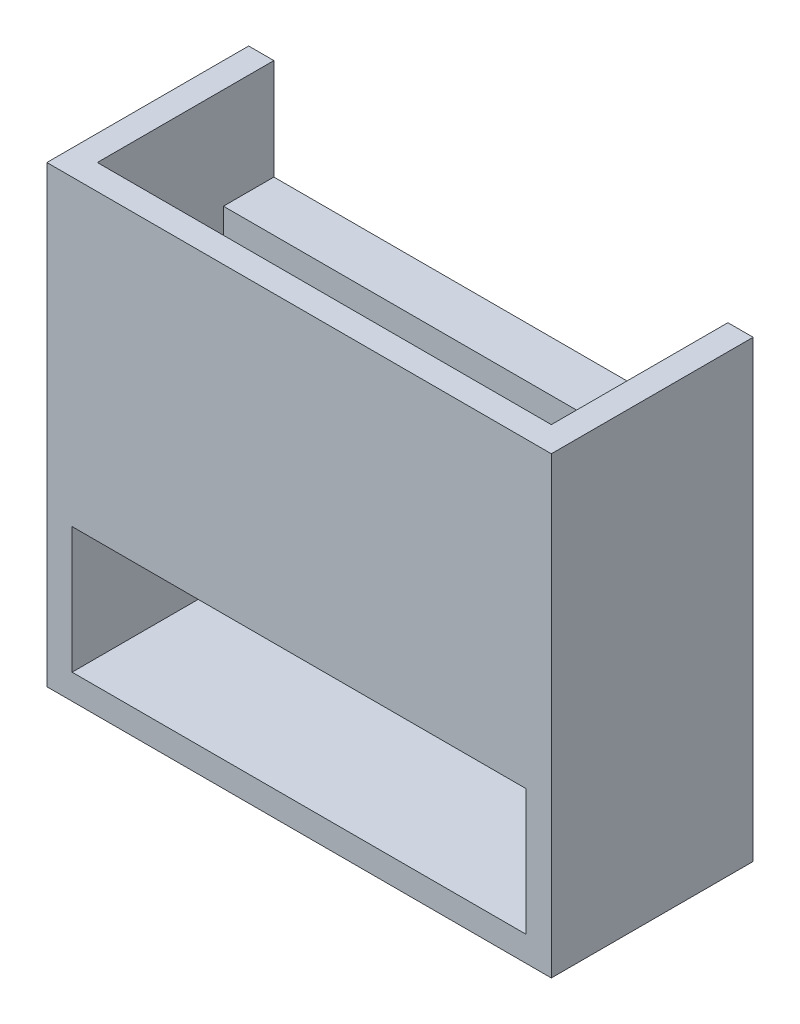
ISO-10303-21;
HEADER;
FILE_DESCRIPTION(('STEP AP214'),'2;1');
FILE_NAME('part.step','',(''),(''),'','','');
FILE_SCHEMA(('AUTOMOTIVE_DESIGN { 1 0 10303 214 1 1 1 1 }'));
ENDSEC;
DATA;
#1=APPLICATION_CONTEXT('core data for automotive mechanical design processes');
#2=APPLICATION_PROTOCOL_DEFINITION('international standard','automotive_design',2000,#1);
#3=PRODUCT_CONTEXT('',#1,'mechanical');
#4=PRODUCT('Part','Part','',(#3));
#5=PRODUCT_RELATED_PRODUCT_CATEGORY('part','',(#4));
#6=PRODUCT_DEFINITION_FORMATION('','',#4);
#7=PRODUCT_DEFINITION_CONTEXT('part definition',#1,'design');
#8=PRODUCT_DEFINITION('design','',#6,#7);
#9=PRODUCT_DEFINITION_SHAPE('','',#8);
#10=(LENGTH_UNIT() NAMED_UNIT(*) SI_UNIT(.MILLI.,.METRE.));
#11=(NAMED_UNIT(*) PLANE_ANGLE_UNIT() SI_UNIT($,.RADIAN.));
#12=(NAMED_UNIT(*) SI_UNIT($,.STERADIAN.) SOLID_ANGLE_UNIT());
#13=UNCERTAINTY_MEASURE_WITH_UNIT(LENGTH_MEASURE(1.E-05),#10,'distance_accuracy_value','');
#14=(GEOMETRIC_REPRESENTATION_CONTEXT(3) GLOBAL_UNCERTAINTY_ASSIGNED_CONTEXT((#13)) GLOBAL_UNIT_ASSIGNED_CONTEXT((#10,
#11,#12)) REPRESENTATION_CONTEXT('',''));
#15=CARTESIAN_POINT('',(0.,0.,0.));
#16=DIRECTION('',(0.,0.,1.));
#17=DIRECTION('',(1.,0.,0.));
#18=AXIS2_PLACEMENT_3D('',#15,#16,#17);
#19=CARTESIAN_POINT('',(-10.,9.,8.));
#20=DIRECTION('',(0.,-1.,0.));
#21=DIRECTION('',(1.,0.,0.));
#22=AXIS2_PLACEMENT_3D('',#19,#20,#21);
#23=PLANE('',#22);
#24=DIRECTION('',(0.,0.,-1.));
#25=VECTOR('',#24,1.);
#26=CARTESIAN_POINT('',(-9.,9.,8.));
#27=LINE('',#26,#25);
#28=CARTESIAN_POINT('',(-9.,9.,7.));
#29=VERTEX_POINT('',#28);
#30=CARTESIAN_POINT('',(-9.,9.,0.));
#31=VERTEX_POINT('',#30);
#32=EDGE_CURVE('E127',#29,#31,#27,.T.);
#33=ORIENTED_EDGE('',*,*,#32,.T.);
#34=DIRECTION('',(-1.,0.,0.));
#35=VECTOR('',#34,1.);
#36=CARTESIAN_POINT('',(-10.,9.,0.));
#37=LINE('',#36,#35);
#38=CARTESIAN_POINT('',(-10.,9.,0.));
#39=VERTEX_POINT('',#38);
#40=EDGE_CURVE('E131',#31,#39,#37,.T.);
#41=ORIENTED_EDGE('',*,*,#40,.T.);
#42=DIRECTION('',(0.,0.,-1.));
#43=VECTOR('',#42,1.);
#44=CARTESIAN_POINT('',(-10.,9.,8.));
#45=LINE('',#44,#43);
#46=CARTESIAN_POINT('',(-10.,9.,8.));
#47=VERTEX_POINT('',#46);
#48=EDGE_CURVE('E174',#47,#39,#45,.T.);
#49=ORIENTED_EDGE('',*,*,#48,.F.);
#50=DIRECTION('',(-1.,0.,0.));
#51=VECTOR('',#50,1.);
#52=CARTESIAN_POINT('',(-10.,9.,8.));
#53=LINE('',#52,#51);
#54=CARTESIAN_POINT('',(10.,9.,8.));
#55=VERTEX_POINT('',#54);
#56=EDGE_CURVE('E177',#55,#47,#53,.T.);
#57=ORIENTED_EDGE('',*,*,#56,.F.);
#58=DIRECTION('',(0.,0.,-1.));
#59=VECTOR('',#58,1.);
#60=CARTESIAN_POINT('',(10.,9.,8.));
#61=LINE('',#60,#59);
#62=CARTESIAN_POINT('',(10.,9.,0.));
#63=VERTEX_POINT('',#62);
#64=EDGE_CURVE('E47',#55,#63,#61,.T.);
#65=ORIENTED_EDGE('',*,*,#64,.T.);
#66=CARTESIAN_POINT('',(9.,9.,0.));
#67=VERTEX_POINT('',#66);
#68=EDGE_CURVE('E154',#63,#67,#37,.T.);
#69=ORIENTED_EDGE('',*,*,#68,.T.);
#70=DIRECTION('',(0.,0.,1.));
#71=VECTOR('',#70,1.);
#72=CARTESIAN_POINT('',(9.,9.,8.));
#73=LINE('',#72,#71);
#74=CARTESIAN_POINT('',(9.,9.,7.));
#75=VERTEX_POINT('',#74);
#76=EDGE_CURVE('E137',#67,#75,#73,.T.);
#77=ORIENTED_EDGE('',*,*,#76,.T.);
#78=DIRECTION('',(1.,0.,0.));
#79=VECTOR('',#78,1.);
#80=CARTESIAN_POINT('',(-10.,9.,7.));
#81=LINE('',#80,#79);
#82=EDGE_CURVE('E134',#29,#75,#81,.T.);
#83=ORIENTED_EDGE('',*,*,#82,.F.);
#84=EDGE_LOOP('',(#33,#41,#49,#57,#65,#69,#77,#83));
#85=FACE_BOUND('',#84,.T.);
#86=ADVANCED_FACE('F39',(#85),#23,.F.);
#87=CARTESIAN_POINT('',(0.,0.,0.));
#88=DIRECTION('',(0.,0.,1.));
#89=DIRECTION('',(1.,0.,0.));
#90=AXIS2_PLACEMENT_3D('',#87,#88,#89);
#91=PLANE('',#90);
#92=DIRECTION('',(0.,-1.,0.));
#93=VECTOR('',#92,1.);
#94=CARTESIAN_POINT('',(-9.,0.,0.));
#95=LINE('',#94,#93);
#96=CARTESIAN_POINT('',(-9.,5.,0.));
#97=VERTEX_POINT('',#96);
#98=EDGE_CURVE('E141',#31,#97,#95,.T.);
#99=ORIENTED_EDGE('',*,*,#98,.T.);
#100=DIRECTION('',(-1.,0.,0.));
#101=VECTOR('',#100,1.);
#102=CARTESIAN_POINT('',(0.,5.,0.));
#103=LINE('',#102,#101);
#104=CARTESIAN_POINT('',(9.,5.,0.));
#105=VERTEX_POINT('',#104);
#106=EDGE_CURVE('E184',#105,#97,#103,.T.);
#107=ORIENTED_EDGE('',*,*,#106,.F.);
#108=DIRECTION('',(0.,-1.,0.));
#109=VECTOR('',#108,1.);
#110=CARTESIAN_POINT('',(9.,0.,0.));
#111=LINE('',#110,#109);
#112=EDGE_CURVE('E148',#67,#105,#111,.T.);
#113=ORIENTED_EDGE('',*,*,#112,.F.);
#114=ORIENTED_EDGE('',*,*,#68,.F.);
#115=DIRECTION('',(0.,1.,0.));
#116=VECTOR('',#115,1.);
#117=CARTESIAN_POINT('',(10.,9.,0.));
#118=LINE('',#117,#116);
#119=CARTESIAN_POINT('',(10.,-9.,0.));
#120=VERTEX_POINT('',#119);
#121=EDGE_CURVE('E155',#120,#63,#118,.T.);
#122=ORIENTED_EDGE('',*,*,#121,.F.);
#123=DIRECTION('',(1.,0.,0.));
#124=VECTOR('',#123,1.);
#125=CARTESIAN_POINT('',(-10.,-9.,0.));
#126=LINE('',#125,#124);
#127=CARTESIAN_POINT('',(-10.,-9.,0.));
#128=VERTEX_POINT('',#127);
#129=EDGE_CURVE('E164',#128,#120,#126,.T.);
#130=ORIENTED_EDGE('',*,*,#129,.F.);
#131=DIRECTION('',(0.,-1.,0.));
#132=VECTOR('',#131,1.);
#133=CARTESIAN_POINT('',(-10.,9.,0.));
#134=LINE('',#133,#132);
#135=EDGE_CURVE('E153',#39,#128,#134,.T.);
#136=ORIENTED_EDGE('',*,*,#135,.F.);
#137=ORIENTED_EDGE('',*,*,#40,.F.);
#138=EDGE_LOOP('',(#99,#107,#113,#114,#122,#130,#136,#137));
#139=FACE_BOUND('',#138,.T.);
#140=ADVANCED_FACE('F151',(#139),#91,.F.);
#141=CARTESIAN_POINT('',(0.,-3.,2.));
#142=DIRECTION('',(0.,-1.,0.));
#143=DIRECTION('',(0.,0.,-1.));
#144=AXIS2_PLACEMENT_3D('',#141,#142,#143);
#145=PLANE('',#144);
#146=DIRECTION('',(0.,0.,1.));
#147=VECTOR('',#146,1.);
#148=CARTESIAN_POINT('',(-9.,-3.,2.));
#149=LINE('',#148,#147);
#150=CARTESIAN_POINT('',(-9.,-3.,7.));
#151=VERTEX_POINT('',#150);
#152=CARTESIAN_POINT('',(-9.,-3.,8.));
#153=VERTEX_POINT('',#152);
#154=EDGE_CURVE('E218',#151,#153,#149,.T.);
#155=ORIENTED_EDGE('',*,*,#154,.F.);
#156=DIRECTION('',(1.,0.,0.));
#157=VECTOR('',#156,1.);
#158=CARTESIAN_POINT('',(0.,-3.,7.));
#159=LINE('',#158,#157);
#160=CARTESIAN_POINT('',(9.,-3.,7.));
#161=VERTEX_POINT('',#160);
#162=EDGE_CURVE('E189',#151,#161,#159,.T.);
#163=ORIENTED_EDGE('',*,*,#162,.T.);
#164=DIRECTION('',(0.,0.,1.));
#165=VECTOR('',#164,1.);
#166=CARTESIAN_POINT('',(9.,-3.,2.));
#167=LINE('',#166,#165);
#168=CARTESIAN_POINT('',(9.,-3.,8.));
#169=VERTEX_POINT('',#168);
#170=EDGE_CURVE('E220',#161,#169,#167,.T.);
#171=ORIENTED_EDGE('',*,*,#170,.T.);
#172=DIRECTION('',(1.,0.,0.));
#173=VECTOR('',#172,1.);
#174=CARTESIAN_POINT('',(0.,-3.,8.));
#175=LINE('',#174,#173);
#176=EDGE_CURVE('E212',#153,#169,#175,.T.);
#177=ORIENTED_EDGE('',*,*,#176,.F.);
#178=EDGE_LOOP('',(#155,#163,#171,#177));
#179=FACE_BOUND('',#178,.T.);
#180=ADVANCED_FACE('F242',(#179),#145,.T.);
#181=CARTESIAN_POINT('',(10.,9.,8.));
#182=DIRECTION('',(-1.,0.,0.));
#183=DIRECTION('',(0.,-1.,0.));
#184=AXIS2_PLACEMENT_3D('',#181,#182,#183);
#185=PLANE('',#184);
#186=ORIENTED_EDGE('',*,*,#121,.T.);
#187=ORIENTED_EDGE('',*,*,#64,.F.);
#188=DIRECTION('',(0.,1.,0.));
#189=VECTOR('',#188,1.);
#190=CARTESIAN_POINT('',(10.,9.,8.));
#191=LINE('',#190,#189);
#192=CARTESIAN_POINT('',(10.,-9.,8.));
#193=VERTEX_POINT('',#192);
#194=EDGE_CURVE('E166',#193,#55,#191,.T.);
#195=ORIENTED_EDGE('',*,*,#194,.F.);
#196=DIRECTION('',(0.,0.,-1.));
#197=VECTOR('',#196,1.);
#198=CARTESIAN_POINT('',(10.,-9.,8.));
#199=LINE('',#198,#197);
#200=EDGE_CURVE('E167',#193,#120,#199,.T.);
#201=ORIENTED_EDGE('',*,*,#200,.T.);
#202=EDGE_LOOP('',(#186,#187,#195,#201));
#203=FACE_BOUND('',#202,.T.);
#204=ADVANCED_FACE('F41',(#203),#185,.F.);
#205=CARTESIAN_POINT('',(-10.,9.,8.));
#206=DIRECTION('',(1.,0.,0.));
#207=DIRECTION('',(0.,1.,0.));
#208=AXIS2_PLACEMENT_3D('',#205,#206,#207);
#209=PLANE('',#208);
#210=ORIENTED_EDGE('',*,*,#135,.T.);
#211=DIRECTION('',(0.,0.,-1.));
#212=VECTOR('',#211,1.);
#213=CARTESIAN_POINT('',(-10.,-9.,8.));
#214=LINE('',#213,#212);
#215=CARTESIAN_POINT('',(-10.,-9.,8.));
#216=VERTEX_POINT('',#215);
#217=EDGE_CURVE('E170',#216,#128,#214,.T.);
#218=ORIENTED_EDGE('',*,*,#217,.F.);
#219=DIRECTION('',(0.,-1.,0.));
#220=VECTOR('',#219,1.);
#221=CARTESIAN_POINT('',(-10.,9.,8.));
#222=LINE('',#221,#220);
#223=EDGE_CURVE('E225',#47,#216,#222,.T.);
#224=ORIENTED_EDGE('',*,*,#223,.F.);
#225=ORIENTED_EDGE('',*,*,#48,.T.);
#226=EDGE_LOOP('',(#210,#218,#224,#225));
#227=FACE_BOUND('',#226,.T.);
#228=ADVANCED_FACE('F234',(#227),#209,.F.);
#229=CARTESIAN_POINT('',(-10.,-9.,8.));
#230=DIRECTION('',(0.,1.,0.));
#231=DIRECTION('',(0.,0.,1.));
#232=AXIS2_PLACEMENT_3D('',#229,#230,#231);
#233=PLANE('',#232);
#234=ORIENTED_EDGE('',*,*,#129,.T.);
#235=ORIENTED_EDGE('',*,*,#200,.F.);
#236=DIRECTION('',(1.,0.,0.));
#237=VECTOR('',#236,1.);
#238=CARTESIAN_POINT('',(-10.,-9.,8.));
#239=LINE('',#238,#237);
#240=EDGE_CURVE('E171',#216,#193,#239,.T.);
#241=ORIENTED_EDGE('',*,*,#240,.F.);
#242=ORIENTED_EDGE('',*,*,#217,.T.);
#243=EDGE_LOOP('',(#234,#235,#241,#242));
#244=FACE_BOUND('',#243,.T.);
#245=ADVANCED_FACE('F232',(#244),#233,.F.);
#246=CARTESIAN_POINT('',(0.,0.,8.));
#247=DIRECTION('',(0.,0.,1.));
#248=DIRECTION('',(1.,0.,0.));
#249=AXIS2_PLACEMENT_3D('',#246,#247,#248);
#250=PLANE('',#249);
#251=DIRECTION('',(1.,0.,0.));
#252=VECTOR('',#251,1.);
#253=CARTESIAN_POINT('',(0.,-8.,8.));
#254=LINE('',#253,#252);
#255=CARTESIAN_POINT('',(-9.,-8.,8.));
#256=VERTEX_POINT('',#255);
#257=CARTESIAN_POINT('',(9.,-8.,8.));
#258=VERTEX_POINT('',#257);
#259=EDGE_CURVE('E61',#256,#258,#254,.T.);
#260=ORIENTED_EDGE('',*,*,#259,.F.);
#261=DIRECTION('',(0.,1.,0.));
#262=VECTOR('',#261,1.);
#263=CARTESIAN_POINT('',(-9.,0.,8.));
#264=LINE('',#263,#262);
#265=EDGE_CURVE('E202',#256,#153,#264,.T.);
#266=ORIENTED_EDGE('',*,*,#265,.T.);
#267=ORIENTED_EDGE('',*,*,#176,.T.);
#268=DIRECTION('',(0.,1.,0.));
#269=VECTOR('',#268,1.);
#270=CARTESIAN_POINT('',(9.,0.,8.));
#271=LINE('',#270,#269);
#272=EDGE_CURVE('E209',#258,#169,#271,.T.);
#273=ORIENTED_EDGE('',*,*,#272,.F.);
#274=EDGE_LOOP('',(#260,#266,#267,#273));
#275=FACE_BOUND('',#274,.T.);
#276=ORIENTED_EDGE('',*,*,#194,.T.);
#277=ORIENTED_EDGE('',*,*,#56,.T.);
#278=ORIENTED_EDGE('',*,*,#223,.T.);
#279=ORIENTED_EDGE('',*,*,#240,.T.);
#280=EDGE_LOOP('',(#276,#277,#278,#279));
#281=FACE_BOUND('',#280,.T.);
#282=ADVANCED_FACE('F228',(#275,#281),#250,.T.);
#283=CARTESIAN_POINT('',(0.,-8.,2.));
#284=DIRECTION('',(0.,-1.,0.));
#285=DIRECTION('',(0.,0.,-1.));
#286=AXIS2_PLACEMENT_3D('',#283,#284,#285);
#287=PLANE('',#286);
#288=ORIENTED_EDGE('',*,*,#259,.T.);
#289=DIRECTION('',(0.,0.,1.));
#290=VECTOR('',#289,1.);
#291=CARTESIAN_POINT('',(9.,-8.,2.));
#292=LINE('',#291,#290);
#293=CARTESIAN_POINT('',(9.,-8.,2.));
#294=VERTEX_POINT('',#293);
#295=EDGE_CURVE('E207',#294,#258,#292,.T.);
#296=ORIENTED_EDGE('',*,*,#295,.F.);
#297=DIRECTION('',(1.,0.,0.));
#298=VECTOR('',#297,1.);
#299=CARTESIAN_POINT('',(0.,-8.,2.));
#300=LINE('',#299,#298);
#301=CARTESIAN_POINT('',(-9.,-8.,2.));
#302=VERTEX_POINT('',#301);
#303=EDGE_CURVE('E198',#302,#294,#300,.T.);
#304=ORIENTED_EDGE('',*,*,#303,.F.);
#305=DIRECTION('',(0.,0.,1.));
#306=VECTOR('',#305,1.);
#307=CARTESIAN_POINT('',(-9.,-8.,2.));
#308=LINE('',#307,#306);
#309=EDGE_CURVE('E159',#302,#256,#308,.T.);
#310=ORIENTED_EDGE('',*,*,#309,.T.);
#311=EDGE_LOOP('',(#288,#296,#304,#310));
#312=FACE_BOUND('',#311,.T.);
#313=ADVANCED_FACE('F258',(#312),#287,.F.);
#314=CARTESIAN_POINT('',(-9.,0.,2.));
#315=DIRECTION('',(1.,0.,0.));
#316=DIRECTION('',(0.,0.,-1.));
#317=AXIS2_PLACEMENT_3D('',#314,#315,#316);
#318=PLANE('',#317);
#319=DIRECTION('',(0.,1.,0.));
#320=VECTOR('',#319,1.);
#321=CARTESIAN_POINT('',(-9.,0.,2.));
#322=LINE('',#321,#320);
#323=CARTESIAN_POINT('',(-9.,5.,2.));
#324=VERTEX_POINT('',#323);
#325=EDGE_CURVE('E205',#302,#324,#322,.T.);
#326=ORIENTED_EDGE('',*,*,#325,.T.);
#327=DIRECTION('',(0.,0.,-1.));
#328=VECTOR('',#327,1.);
#329=CARTESIAN_POINT('',(-9.,5.,4.));
#330=LINE('',#329,#328);
#331=EDGE_CURVE('E144',#324,#97,#330,.T.);
#332=ORIENTED_EDGE('',*,*,#331,.T.);
#333=ORIENTED_EDGE('',*,*,#98,.F.);
#334=ORIENTED_EDGE('',*,*,#32,.F.);
#335=DIRECTION('',(0.,-1.,0.));
#336=VECTOR('',#335,1.);
#337=CARTESIAN_POINT('',(-9.,10.,7.));
#338=LINE('',#337,#336);
#339=EDGE_CURVE('E193',#29,#151,#338,.T.);
#340=ORIENTED_EDGE('',*,*,#339,.T.);
#341=ORIENTED_EDGE('',*,*,#154,.T.);
#342=ORIENTED_EDGE('',*,*,#265,.F.);
#343=ORIENTED_EDGE('',*,*,#309,.F.);
#344=EDGE_LOOP('',(#326,#332,#333,#334,#340,#341,#342,#343));
#345=FACE_BOUND('',#344,.T.);
#346=ADVANCED_FACE('F143',(#345),#318,.T.);
#347=CARTESIAN_POINT('',(9.,0.,2.));
#348=DIRECTION('',(1.,0.,0.));
#349=DIRECTION('',(0.,0.,-1.));
#350=AXIS2_PLACEMENT_3D('',#347,#348,#349);
#351=PLANE('',#350);
#352=DIRECTION('',(0.,0.,-1.));
#353=VECTOR('',#352,1.);
#354=CARTESIAN_POINT('',(9.,5.,4.));
#355=LINE('',#354,#353);
#356=CARTESIAN_POINT('',(9.,5.,2.));
#357=VERTEX_POINT('',#356);
#358=EDGE_CURVE('E54',#357,#105,#355,.T.);
#359=ORIENTED_EDGE('',*,*,#358,.F.);
#360=DIRECTION('',(0.,1.,0.));
#361=VECTOR('',#360,1.);
#362=CARTESIAN_POINT('',(9.,0.,2.));
#363=LINE('',#362,#361);
#364=EDGE_CURVE('E201',#294,#357,#363,.T.);
#365=ORIENTED_EDGE('',*,*,#364,.F.);
#366=ORIENTED_EDGE('',*,*,#295,.T.);
#367=ORIENTED_EDGE('',*,*,#272,.T.);
#368=ORIENTED_EDGE('',*,*,#170,.F.);
#369=DIRECTION('',(0.,-1.,0.));
#370=VECTOR('',#369,1.);
#371=CARTESIAN_POINT('',(9.,10.,7.));
#372=LINE('',#371,#370);
#373=EDGE_CURVE('E138',#75,#161,#372,.T.);
#374=ORIENTED_EDGE('',*,*,#373,.F.);
#375=ORIENTED_EDGE('',*,*,#76,.F.);
#376=ORIENTED_EDGE('',*,*,#112,.T.);
#377=EDGE_LOOP('',(#359,#365,#366,#367,#368,#374,#375,#376));
#378=FACE_BOUND('',#377,.T.);
#379=ADVANCED_FACE('F262',(#378),#351,.F.);
#380=CARTESIAN_POINT('',(0.,0.,2.));
#381=DIRECTION('',(0.,0.,1.));
#382=DIRECTION('',(1.,0.,0.));
#383=AXIS2_PLACEMENT_3D('',#380,#381,#382);
#384=PLANE('',#383);
#385=DIRECTION('',(1.,0.,0.));
#386=VECTOR('',#385,1.);
#387=CARTESIAN_POINT('',(0.,5.,2.));
#388=LINE('',#387,#386);
#389=EDGE_CURVE('E11',#324,#357,#388,.T.);
#390=ORIENTED_EDGE('',*,*,#389,.F.);
#391=ORIENTED_EDGE('',*,*,#325,.F.);
#392=ORIENTED_EDGE('',*,*,#303,.T.);
#393=ORIENTED_EDGE('',*,*,#364,.T.);
#394=EDGE_LOOP('',(#390,#391,#392,#393));
#395=FACE_BOUND('',#394,.T.);
#396=ADVANCED_FACE('F264',(#395),#384,.T.);
#397=CARTESIAN_POINT('',(0.,10.,7.));
#398=DIRECTION('',(0.,0.,-1.));
#399=DIRECTION('',(-1.,0.,0.));
#400=AXIS2_PLACEMENT_3D('',#397,#398,#399);
#401=PLANE('',#400);
#402=ORIENTED_EDGE('',*,*,#82,.T.);
#403=ORIENTED_EDGE('',*,*,#373,.T.);
#404=ORIENTED_EDGE('',*,*,#162,.F.);
#405=ORIENTED_EDGE('',*,*,#339,.F.);
#406=EDGE_LOOP('',(#402,#403,#404,#405));
#407=FACE_BOUND('',#406,.T.);
#408=ADVANCED_FACE('F269',(#407),#401,.T.);
#409=CARTESIAN_POINT('',(0.,5.,4.));
#410=DIRECTION('',(0.,-1.,0.));
#411=DIRECTION('',(0.,0.,-1.));
#412=AXIS2_PLACEMENT_3D('',#409,#410,#411);
#413=PLANE('',#412);
#414=ORIENTED_EDGE('',*,*,#389,.T.);
#415=ORIENTED_EDGE('',*,*,#358,.T.);
#416=ORIENTED_EDGE('',*,*,#106,.T.);
#417=ORIENTED_EDGE('',*,*,#331,.F.);
#418=EDGE_LOOP('',(#414,#415,#416,#417));
#419=FACE_BOUND('',#418,.T.);
#420=ADVANCED_FACE('F272',(#419),#413,.F.);
#421=CLOSED_SHELL('',(#86,#140,#180,#204,#228,#245,#282,#313,#346,#379,#396,#408,#420));
#422=MANIFOLD_SOLID_BREP('B2',#421);
#423=ADVANCED_BREP_SHAPE_REPRESENTATION('',(#18,#422),#14);
#424=SHAPE_DEFINITION_REPRESENTATION(#9,#423);
ENDSEC;
END-ISO-10303-21;
